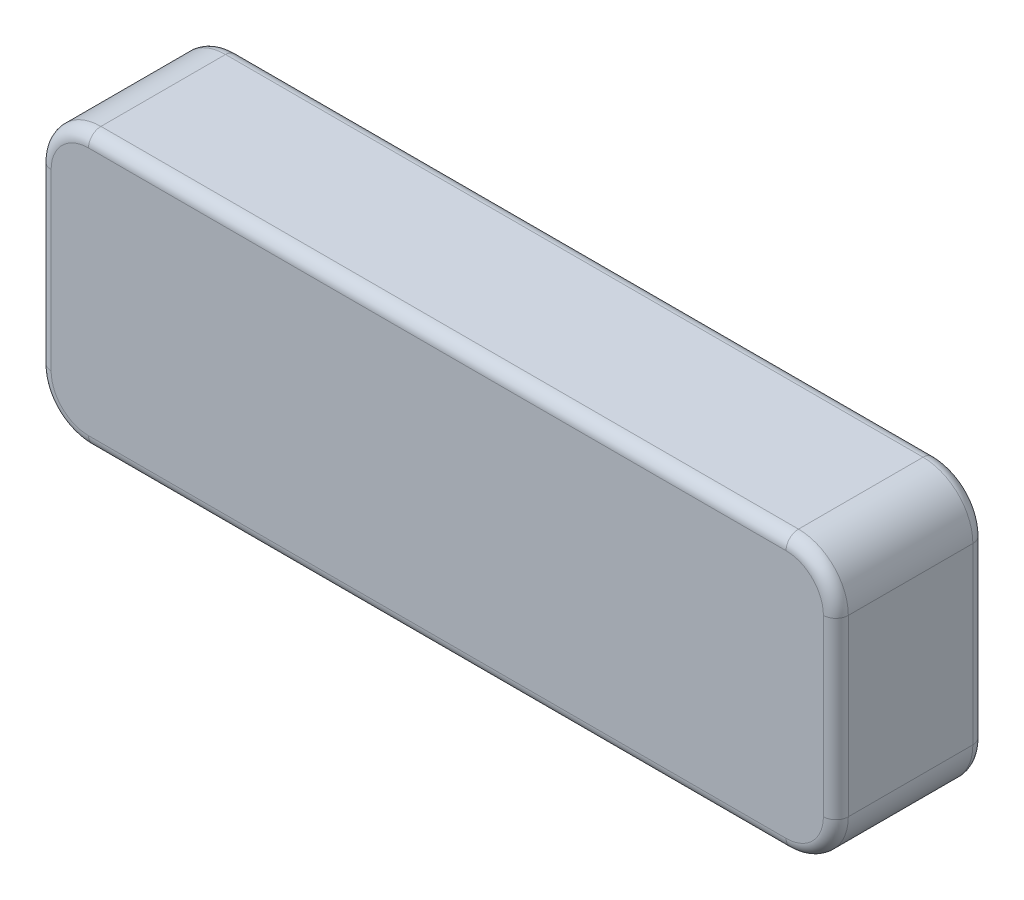
ISO-10303-21;
HEADER;
FILE_DESCRIPTION(('STEP AP214'),'2;1');
FILE_NAME('part.step','',(''),(''),'','','');
FILE_SCHEMA(('AUTOMOTIVE_DESIGN { 1 0 10303 214 1 1 1 1 }'));
ENDSEC;
DATA;
#1=APPLICATION_CONTEXT('core data for automotive mechanical design processes');
#2=APPLICATION_PROTOCOL_DEFINITION('international standard','automotive_design',2000,#1);
#3=PRODUCT_CONTEXT('',#1,'mechanical');
#4=PRODUCT('Part','Part','',(#3));
#5=PRODUCT_RELATED_PRODUCT_CATEGORY('part','',(#4));
#6=PRODUCT_DEFINITION_FORMATION('','',#4);
#7=PRODUCT_DEFINITION_CONTEXT('part definition',#1,'design');
#8=PRODUCT_DEFINITION('design','',#6,#7);
#9=PRODUCT_DEFINITION_SHAPE('','',#8);
#10=(LENGTH_UNIT() NAMED_UNIT(*) SI_UNIT(.MILLI.,.METRE.));
#11=(NAMED_UNIT(*) PLANE_ANGLE_UNIT() SI_UNIT($,.RADIAN.));
#12=(NAMED_UNIT(*) SI_UNIT($,.STERADIAN.) SOLID_ANGLE_UNIT());
#13=UNCERTAINTY_MEASURE_WITH_UNIT(LENGTH_MEASURE(1.E-05),#10,'distance_accuracy_value','');
#14=(GEOMETRIC_REPRESENTATION_CONTEXT(3) GLOBAL_UNCERTAINTY_ASSIGNED_CONTEXT((#13)) GLOBAL_UNIT_ASSIGNED_CONTEXT((#10,
#11,#12)) REPRESENTATION_CONTEXT('',''));
#15=CARTESIAN_POINT('',(0.,0.,0.));
#16=DIRECTION('',(0.,0.,1.));
#17=DIRECTION('',(1.,0.,0.));
#18=AXIS2_PLACEMENT_3D('',#15,#16,#17);
#19=CARTESIAN_POINT('',(203.2,-69.85,76.2));
#20=DIRECTION('',(-1.,0.,0.));
#21=DIRECTION('',(0.,0.,1.));
#22=AXIS2_PLACEMENT_3D('',#19,#20,#21);
#23=PLANE('',#22);
#24=DIRECTION('',(0.,0.,-1.));
#25=VECTOR('',#24,1.);
#26=CARTESIAN_POINT('',(203.2,-44.45,76.2));
#27=LINE('',#26,#25);
#28=CARTESIAN_POINT('',(203.2,-44.45,69.85));
#29=VERTEX_POINT('',#28);
#30=CARTESIAN_POINT('',(203.2,-44.45,6.34999999999999));
#31=VERTEX_POINT('',#30);
#32=EDGE_CURVE('E303',#29,#31,#27,.T.);
#33=ORIENTED_EDGE('',*,*,#32,.T.);
#34=DIRECTION('',(0.,1.,0.));
#35=VECTOR('',#34,1.);
#36=CARTESIAN_POINT('',(203.2,44.45,6.34999999999999));
#37=LINE('',#36,#35);
#38=CARTESIAN_POINT('',(203.2,44.45,6.34999999999999));
#39=VERTEX_POINT('',#38);
#40=EDGE_CURVE('E197',#31,#39,#37,.T.);
#41=ORIENTED_EDGE('',*,*,#40,.T.);
#42=DIRECTION('',(0.,0.,-1.));
#43=VECTOR('',#42,1.);
#44=CARTESIAN_POINT('',(203.2,44.45,76.2));
#45=LINE('',#44,#43);
#46=CARTESIAN_POINT('',(203.2,44.45,69.85));
#47=VERTEX_POINT('',#46);
#48=EDGE_CURVE('E248',#39,#47,#45,.F.);
#49=ORIENTED_EDGE('',*,*,#48,.T.);
#50=DIRECTION('',(0.,1.,0.));
#51=VECTOR('',#50,1.);
#52=CARTESIAN_POINT('',(203.2,-69.85,69.85));
#53=LINE('',#52,#51);
#54=EDGE_CURVE('E195',#47,#29,#53,.F.);
#55=ORIENTED_EDGE('',*,*,#54,.T.);
#56=EDGE_LOOP('',(#33,#41,#49,#55));
#57=FACE_BOUND('',#56,.T.);
#58=ADVANCED_FACE('F32',(#57),#23,.F.);
#59=CARTESIAN_POINT('',(-203.2,69.85,76.2));
#60=DIRECTION('',(0.,-1.,0.));
#61=DIRECTION('',(0.,0.,-1.));
#62=AXIS2_PLACEMENT_3D('',#59,#60,#61);
#63=PLANE('',#62);
#64=DIRECTION('',(0.,0.,-1.));
#65=VECTOR('',#64,1.);
#66=CARTESIAN_POINT('',(177.8,69.85,76.2));
#67=LINE('',#66,#65);
#68=CARTESIAN_POINT('',(177.8,69.85,69.85));
#69=VERTEX_POINT('',#68);
#70=CARTESIAN_POINT('',(177.8,69.85,6.34999999999999));
#71=VERTEX_POINT('',#70);
#72=EDGE_CURVE('E174',#69,#71,#67,.T.);
#73=ORIENTED_EDGE('',*,*,#72,.T.);
#74=DIRECTION('',(-1.,0.,0.));
#75=VECTOR('',#74,1.);
#76=CARTESIAN_POINT('',(-177.8,69.85,6.34999999999999));
#77=LINE('',#76,#75);
#78=CARTESIAN_POINT('',(-177.8,69.85,6.34999999999999));
#79=VERTEX_POINT('',#78);
#80=EDGE_CURVE('E11',#71,#79,#77,.T.);
#81=ORIENTED_EDGE('',*,*,#80,.T.);
#82=DIRECTION('',(0.,0.,-1.));
#83=VECTOR('',#82,1.);
#84=CARTESIAN_POINT('',(-177.8,69.85,76.2));
#85=LINE('',#84,#83);
#86=CARTESIAN_POINT('',(-177.8,69.85,69.85));
#87=VERTEX_POINT('',#86);
#88=EDGE_CURVE('E171',#79,#87,#85,.F.);
#89=ORIENTED_EDGE('',*,*,#88,.T.);
#90=DIRECTION('',(-1.,0.,0.));
#91=VECTOR('',#90,1.);
#92=CARTESIAN_POINT('',(-203.2,69.85,69.85));
#93=LINE('',#92,#91);
#94=EDGE_CURVE('E41',#87,#69,#93,.F.);
#95=ORIENTED_EDGE('',*,*,#94,.T.);
#96=EDGE_LOOP('',(#73,#81,#89,#95));
#97=FACE_BOUND('',#96,.T.);
#98=ADVANCED_FACE('F349',(#97),#63,.F.);
#99=CARTESIAN_POINT('',(-203.2,-69.85,76.2));
#100=DIRECTION('',(1.,0.,0.));
#101=DIRECTION('',(0.,0.,-1.));
#102=AXIS2_PLACEMENT_3D('',#99,#100,#101);
#103=PLANE('',#102);
#104=DIRECTION('',(0.,0.,-1.));
#105=VECTOR('',#104,1.);
#106=CARTESIAN_POINT('',(-203.2,44.45,76.2));
#107=LINE('',#106,#105);
#108=CARTESIAN_POINT('',(-203.2,44.45,69.85));
#109=VERTEX_POINT('',#108);
#110=CARTESIAN_POINT('',(-203.2,44.45,6.34999999999999));
#111=VERTEX_POINT('',#110);
#112=EDGE_CURVE('E294',#109,#111,#107,.T.);
#113=ORIENTED_EDGE('',*,*,#112,.T.);
#114=DIRECTION('',(0.,-1.,0.));
#115=VECTOR('',#114,1.);
#116=CARTESIAN_POINT('',(-203.2,-44.45,6.34999999999999));
#117=LINE('',#116,#115);
#118=CARTESIAN_POINT('',(-203.2,-44.45,6.34999999999999));
#119=VERTEX_POINT('',#118);
#120=EDGE_CURVE('E213',#111,#119,#117,.T.);
#121=ORIENTED_EDGE('',*,*,#120,.T.);
#122=DIRECTION('',(0.,0.,-1.));
#123=VECTOR('',#122,1.);
#124=CARTESIAN_POINT('',(-203.2,-44.45,76.2));
#125=LINE('',#124,#123);
#126=CARTESIAN_POINT('',(-203.2,-44.45,69.85));
#127=VERTEX_POINT('',#126);
#128=EDGE_CURVE('E285',#119,#127,#125,.F.);
#129=ORIENTED_EDGE('',*,*,#128,.T.);
#130=DIRECTION('',(0.,-1.,0.));
#131=VECTOR('',#130,1.);
#132=CARTESIAN_POINT('',(-203.2,-69.85,69.85));
#133=LINE('',#132,#131);
#134=EDGE_CURVE('E211',#127,#109,#133,.F.);
#135=ORIENTED_EDGE('',*,*,#134,.T.);
#136=EDGE_LOOP('',(#113,#121,#129,#135));
#137=FACE_BOUND('',#136,.T.);
#138=ADVANCED_FACE('F291',(#137),#103,.F.);
#139=CARTESIAN_POINT('',(-203.2,-69.85,76.2));
#140=DIRECTION('',(0.,1.,0.));
#141=DIRECTION('',(0.,0.,1.));
#142=AXIS2_PLACEMENT_3D('',#139,#140,#141);
#143=PLANE('',#142);
#144=DIRECTION('',(0.,0.,-1.));
#145=VECTOR('',#144,1.);
#146=CARTESIAN_POINT('',(-177.8,-69.85,76.2));
#147=LINE('',#146,#145);
#148=CARTESIAN_POINT('',(-177.8,-69.85,69.85));
#149=VERTEX_POINT('',#148);
#150=CARTESIAN_POINT('',(-177.8,-69.85,6.34999999999999));
#151=VERTEX_POINT('',#150);
#152=EDGE_CURVE('E288',#149,#151,#147,.T.);
#153=ORIENTED_EDGE('',*,*,#152,.T.);
#154=DIRECTION('',(1.,0.,0.));
#155=VECTOR('',#154,1.);
#156=CARTESIAN_POINT('',(177.8,-69.85,6.34999999999999));
#157=LINE('',#156,#155);
#158=CARTESIAN_POINT('',(177.8,-69.85,6.34999999999999));
#159=VERTEX_POINT('',#158);
#160=EDGE_CURVE('E205',#151,#159,#157,.T.);
#161=ORIENTED_EDGE('',*,*,#160,.T.);
#162=DIRECTION('',(0.,0.,-1.));
#163=VECTOR('',#162,1.);
#164=CARTESIAN_POINT('',(177.8,-69.85,76.2));
#165=LINE('',#164,#163);
#166=CARTESIAN_POINT('',(177.8,-69.85,69.85));
#167=VERTEX_POINT('',#166);
#168=EDGE_CURVE('E297',#159,#167,#165,.F.);
#169=ORIENTED_EDGE('',*,*,#168,.T.);
#170=DIRECTION('',(1.,0.,0.));
#171=VECTOR('',#170,1.);
#172=CARTESIAN_POINT('',(-203.2,-69.85,69.85));
#173=LINE('',#172,#171);
#174=EDGE_CURVE('E203',#167,#149,#173,.F.);
#175=ORIENTED_EDGE('',*,*,#174,.T.);
#176=EDGE_LOOP('',(#153,#161,#169,#175));
#177=FACE_BOUND('',#176,.T.);
#178=ADVANCED_FACE('F531',(#177),#143,.F.);
#179=CARTESIAN_POINT('',(0.,0.,76.2));
#180=DIRECTION('',(0.,0.,-1.));
#181=DIRECTION('',(-1.,0.,0.));
#182=AXIS2_PLACEMENT_3D('',#179,#180,#181);
#183=PLANE('',#182);
#184=DIRECTION('',(0.,1.,0.));
#185=VECTOR('',#184,1.);
#186=CARTESIAN_POINT('',(196.85,0.,76.2));
#187=LINE('',#186,#185);
#188=CARTESIAN_POINT('',(196.85,-44.45,76.2));
#189=VERTEX_POINT('',#188);
#190=CARTESIAN_POINT('',(196.85,44.45,76.2));
#191=VERTEX_POINT('',#190);
#192=EDGE_CURVE('E49',#189,#191,#187,.T.);
#193=ORIENTED_EDGE('',*,*,#192,.T.);
#194=CARTESIAN_POINT('',(177.8,44.45,76.2));
#195=DIRECTION('',(0.,0.,-1.));
#196=DIRECTION('',(-1.,0.,0.));
#197=AXIS2_PLACEMENT_3D('',#194,#195,#196);
#198=CIRCLE('',#197,19.05);
#199=CARTESIAN_POINT('',(177.8,63.5,76.2));
#200=VERTEX_POINT('',#199);
#201=EDGE_CURVE('E230',#191,#200,#198,.F.);
#202=ORIENTED_EDGE('',*,*,#201,.T.);
#203=DIRECTION('',(-1.,0.,0.));
#204=VECTOR('',#203,1.);
#205=CARTESIAN_POINT('',(0.,63.5,76.2));
#206=LINE('',#205,#204);
#207=CARTESIAN_POINT('',(-177.8,63.5,76.2));
#208=VERTEX_POINT('',#207);
#209=EDGE_CURVE('E218',#200,#208,#206,.T.);
#210=ORIENTED_EDGE('',*,*,#209,.T.);
#211=CARTESIAN_POINT('',(-177.8,44.45,76.2));
#212=DIRECTION('',(0.,0.,-1.));
#213=DIRECTION('',(-1.,0.,0.));
#214=AXIS2_PLACEMENT_3D('',#211,#212,#213);
#215=CIRCLE('',#214,19.05);
#216=CARTESIAN_POINT('',(-196.85,44.45,76.2));
#217=VERTEX_POINT('',#216);
#218=EDGE_CURVE('E220',#208,#217,#215,.F.);
#219=ORIENTED_EDGE('',*,*,#218,.T.);
#220=DIRECTION('',(0.,-1.,0.));
#221=VECTOR('',#220,1.);
#222=CARTESIAN_POINT('',(-196.85,0.,76.2));
#223=LINE('',#222,#221);
#224=CARTESIAN_POINT('',(-196.85,-44.45,76.2));
#225=VERTEX_POINT('',#224);
#226=EDGE_CURVE('E222',#217,#225,#223,.T.);
#227=ORIENTED_EDGE('',*,*,#226,.T.);
#228=CARTESIAN_POINT('',(-177.8,-44.45,76.2));
#229=DIRECTION('',(0.,0.,-1.));
#230=DIRECTION('',(-1.,0.,0.));
#231=AXIS2_PLACEMENT_3D('',#228,#229,#230);
#232=CIRCLE('',#231,19.05);
#233=CARTESIAN_POINT('',(-177.8,-63.5,76.2));
#234=VERTEX_POINT('',#233);
#235=EDGE_CURVE('E224',#225,#234,#232,.F.);
#236=ORIENTED_EDGE('',*,*,#235,.T.);
#237=DIRECTION('',(1.,0.,0.));
#238=VECTOR('',#237,1.);
#239=CARTESIAN_POINT('',(0.,-63.5,76.2));
#240=LINE('',#239,#238);
#241=CARTESIAN_POINT('',(177.8,-63.5,76.2));
#242=VERTEX_POINT('',#241);
#243=EDGE_CURVE('E226',#234,#242,#240,.T.);
#244=ORIENTED_EDGE('',*,*,#243,.T.);
#245=CARTESIAN_POINT('',(177.8,-44.45,76.2));
#246=DIRECTION('',(0.,0.,-1.));
#247=DIRECTION('',(-1.,0.,0.));
#248=AXIS2_PLACEMENT_3D('',#245,#246,#247);
#249=CIRCLE('',#248,19.05);
#250=EDGE_CURVE('E54',#242,#189,#249,.F.);
#251=ORIENTED_EDGE('',*,*,#250,.T.);
#252=EDGE_LOOP('',(#193,#202,#210,#219,#227,#236,#244,#251));
#253=FACE_BOUND('',#252,.T.);
#254=ADVANCED_FACE('F523',(#253),#183,.F.);
#255=CARTESIAN_POINT('',(0.,0.,0.));
#256=DIRECTION('',(0.,0.,-1.));
#257=DIRECTION('',(-1.,0.,0.));
#258=AXIS2_PLACEMENT_3D('',#255,#256,#257);
#259=PLANE('',#258);
#260=DIRECTION('',(-1.,0.,0.));
#261=VECTOR('',#260,1.);
#262=CARTESIAN_POINT('',(177.8,63.5,0.));
#263=LINE('',#262,#261);
#264=CARTESIAN_POINT('',(-177.8,63.5,0.));
#265=VERTEX_POINT('',#264);
#266=CARTESIAN_POINT('',(177.8,63.5,0.));
#267=VERTEX_POINT('',#266);
#268=EDGE_CURVE('E150',#265,#267,#263,.F.);
#269=ORIENTED_EDGE('',*,*,#268,.T.);
#270=CARTESIAN_POINT('',(177.8,44.45,0.));
#271=DIRECTION('',(0.,0.,-1.));
#272=DIRECTION('',(-1.,0.,0.));
#273=AXIS2_PLACEMENT_3D('',#270,#271,#272);
#274=CIRCLE('',#273,19.05);
#275=CARTESIAN_POINT('',(196.85,44.45,0.));
#276=VERTEX_POINT('',#275);
#277=EDGE_CURVE('E187',#267,#276,#274,.T.);
#278=ORIENTED_EDGE('',*,*,#277,.T.);
#279=DIRECTION('',(0.,1.,0.));
#280=VECTOR('',#279,1.);
#281=CARTESIAN_POINT('',(196.85,-44.45,0.));
#282=LINE('',#281,#280);
#283=CARTESIAN_POINT('',(196.85,-44.45,0.));
#284=VERTEX_POINT('',#283);
#285=EDGE_CURVE('E185',#276,#284,#282,.F.);
#286=ORIENTED_EDGE('',*,*,#285,.T.);
#287=CARTESIAN_POINT('',(177.8,-44.45,0.));
#288=DIRECTION('',(0.,0.,-1.));
#289=DIRECTION('',(-1.,0.,0.));
#290=AXIS2_PLACEMENT_3D('',#287,#288,#289);
#291=CIRCLE('',#290,19.05);
#292=CARTESIAN_POINT('',(177.8,-63.5,0.));
#293=VERTEX_POINT('',#292);
#294=EDGE_CURVE('E183',#284,#293,#291,.T.);
#295=ORIENTED_EDGE('',*,*,#294,.T.);
#296=DIRECTION('',(1.,0.,0.));
#297=VECTOR('',#296,1.);
#298=CARTESIAN_POINT('',(-177.8,-63.5,0.));
#299=LINE('',#298,#297);
#300=CARTESIAN_POINT('',(-177.8,-63.5,0.));
#301=VERTEX_POINT('',#300);
#302=EDGE_CURVE('E181',#293,#301,#299,.F.);
#303=ORIENTED_EDGE('',*,*,#302,.T.);
#304=CARTESIAN_POINT('',(-177.8,-44.45,0.));
#305=DIRECTION('',(0.,0.,-1.));
#306=DIRECTION('',(-1.,0.,0.));
#307=AXIS2_PLACEMENT_3D('',#304,#305,#306);
#308=CIRCLE('',#307,19.05);
#309=CARTESIAN_POINT('',(-196.85,-44.45,0.));
#310=VERTEX_POINT('',#309);
#311=EDGE_CURVE('E179',#301,#310,#308,.T.);
#312=ORIENTED_EDGE('',*,*,#311,.T.);
#313=DIRECTION('',(0.,-1.,0.));
#314=VECTOR('',#313,1.);
#315=CARTESIAN_POINT('',(-196.85,44.45,0.));
#316=LINE('',#315,#314);
#317=CARTESIAN_POINT('',(-196.85,44.45,0.));
#318=VERTEX_POINT('',#317);
#319=EDGE_CURVE('E153',#310,#318,#316,.F.);
#320=ORIENTED_EDGE('',*,*,#319,.T.);
#321=CARTESIAN_POINT('',(-177.8,44.45,0.));
#322=DIRECTION('',(0.,0.,-1.));
#323=DIRECTION('',(-1.,0.,0.));
#324=AXIS2_PLACEMENT_3D('',#321,#322,#323);
#325=CIRCLE('',#324,19.05);
#326=EDGE_CURVE('E145',#318,#265,#325,.T.);
#327=ORIENTED_EDGE('',*,*,#326,.T.);
#328=EDGE_LOOP('',(#269,#278,#286,#295,#303,#312,#320,#327));
#329=FACE_BOUND('',#328,.T.);
#330=ADVANCED_FACE('F147',(#329),#259,.T.);
#331=CARTESIAN_POINT('',(177.8,-44.45,76.2));
#332=DIRECTION('',(0.,0.,-1.));
#333=DIRECTION('',(-1.,0.,0.));
#334=AXIS2_PLACEMENT_3D('',#331,#332,#333);
#335=CYLINDRICAL_SURFACE('',#334,25.4);
#336=ORIENTED_EDGE('',*,*,#168,.F.);
#337=CARTESIAN_POINT('',(177.8,-44.45,6.34999999999999));
#338=DIRECTION('',(0.,0.,-1.));
#339=DIRECTION('',(-1.,0.,0.));
#340=AXIS2_PLACEMENT_3D('',#337,#338,#339);
#341=CIRCLE('',#340,25.4);
#342=EDGE_CURVE('E201',#159,#31,#341,.F.);
#343=ORIENTED_EDGE('',*,*,#342,.T.);
#344=ORIENTED_EDGE('',*,*,#32,.F.);
#345=CARTESIAN_POINT('',(177.8,-44.45,69.85));
#346=DIRECTION('',(0.,0.,-1.));
#347=DIRECTION('',(-1.,0.,0.));
#348=AXIS2_PLACEMENT_3D('',#345,#346,#347);
#349=CIRCLE('',#348,25.4);
#350=EDGE_CURVE('E199',#29,#167,#349,.T.);
#351=ORIENTED_EDGE('',*,*,#350,.T.);
#352=EDGE_LOOP('',(#336,#343,#344,#351));
#353=FACE_BOUND('',#352,.T.);
#354=ADVANCED_FACE('F358',(#353),#335,.T.);
#355=CARTESIAN_POINT('',(-177.8,-44.45,76.2));
#356=DIRECTION('',(0.,0.,-1.));
#357=DIRECTION('',(-1.,0.,0.));
#358=AXIS2_PLACEMENT_3D('',#355,#356,#357);
#359=CYLINDRICAL_SURFACE('',#358,25.4);
#360=ORIENTED_EDGE('',*,*,#128,.F.);
#361=CARTESIAN_POINT('',(-177.8,-44.45,6.34999999999999));
#362=DIRECTION('',(0.,0.,-1.));
#363=DIRECTION('',(-1.,0.,0.));
#364=AXIS2_PLACEMENT_3D('',#361,#362,#363);
#365=CIRCLE('',#364,25.4);
#366=EDGE_CURVE('E209',#119,#151,#365,.F.);
#367=ORIENTED_EDGE('',*,*,#366,.T.);
#368=ORIENTED_EDGE('',*,*,#152,.F.);
#369=CARTESIAN_POINT('',(-177.8,-44.45,69.85));
#370=DIRECTION('',(0.,0.,-1.));
#371=DIRECTION('',(-1.,0.,0.));
#372=AXIS2_PLACEMENT_3D('',#369,#370,#371);
#373=CIRCLE('',#372,25.4);
#374=EDGE_CURVE('E207',#149,#127,#373,.T.);
#375=ORIENTED_EDGE('',*,*,#374,.T.);
#376=EDGE_LOOP('',(#360,#367,#368,#375));
#377=FACE_BOUND('',#376,.T.);
#378=ADVANCED_FACE('F284',(#377),#359,.T.);
#379=CARTESIAN_POINT('',(-177.8,44.45,76.2));
#380=DIRECTION('',(0.,0.,-1.));
#381=DIRECTION('',(-1.,0.,0.));
#382=AXIS2_PLACEMENT_3D('',#379,#380,#381);
#383=CYLINDRICAL_SURFACE('',#382,25.4);
#384=ORIENTED_EDGE('',*,*,#88,.F.);
#385=CARTESIAN_POINT('',(-177.8,44.45,6.34999999999999));
#386=DIRECTION('',(0.,0.,-1.));
#387=DIRECTION('',(-1.,0.,0.));
#388=AXIS2_PLACEMENT_3D('',#385,#386,#387);
#389=CIRCLE('',#388,25.4);
#390=EDGE_CURVE('E162',#79,#111,#389,.F.);
#391=ORIENTED_EDGE('',*,*,#390,.T.);
#392=ORIENTED_EDGE('',*,*,#112,.F.);
#393=CARTESIAN_POINT('',(-177.8,44.45,69.85));
#394=DIRECTION('',(0.,0.,-1.));
#395=DIRECTION('',(-1.,0.,0.));
#396=AXIS2_PLACEMENT_3D('',#393,#394,#395);
#397=CIRCLE('',#396,25.4);
#398=EDGE_CURVE('E215',#109,#87,#397,.T.);
#399=ORIENTED_EDGE('',*,*,#398,.T.);
#400=EDGE_LOOP('',(#384,#391,#392,#399));
#401=FACE_BOUND('',#400,.T.);
#402=ADVANCED_FACE('F364',(#401),#383,.T.);
#403=CARTESIAN_POINT('',(177.8,44.45,76.2));
#404=DIRECTION('',(0.,0.,-1.));
#405=DIRECTION('',(-1.,0.,0.));
#406=AXIS2_PLACEMENT_3D('',#403,#404,#405);
#407=CYLINDRICAL_SURFACE('',#406,25.4);
#408=ORIENTED_EDGE('',*,*,#48,.F.);
#409=CARTESIAN_POINT('',(177.8,44.45,6.34999999999999));
#410=DIRECTION('',(0.,0.,-1.));
#411=DIRECTION('',(-1.,0.,0.));
#412=AXIS2_PLACEMENT_3D('',#409,#410,#411);
#413=CIRCLE('',#412,25.4);
#414=EDGE_CURVE('E192',#39,#71,#413,.F.);
#415=ORIENTED_EDGE('',*,*,#414,.T.);
#416=ORIENTED_EDGE('',*,*,#72,.F.);
#417=CARTESIAN_POINT('',(177.8,44.45,69.85));
#418=DIRECTION('',(0.,0.,-1.));
#419=DIRECTION('',(-1.,0.,0.));
#420=AXIS2_PLACEMENT_3D('',#417,#418,#419);
#421=CIRCLE('',#420,25.4);
#422=EDGE_CURVE('E189',#69,#47,#421,.T.);
#423=ORIENTED_EDGE('',*,*,#422,.T.);
#424=EDGE_LOOP('',(#408,#415,#416,#423));
#425=FACE_BOUND('',#424,.T.);
#426=ADVANCED_FACE('F314',(#425),#407,.T.);
#427=CARTESIAN_POINT('',(-177.8,-44.45,6.34999999999999));
#428=DIRECTION('',(0.,0.,-1.));
#429=DIRECTION('',(-1.,0.,0.));
#430=AXIS2_PLACEMENT_3D('',#427,#428,#429);
#431=TOROIDAL_SURFACE('',#430,19.05,6.35);
#432=CARTESIAN_POINT('',(-177.8,-63.5,6.34999999999999));
#433=DIRECTION('',(1.,0.,0.));
#434=DIRECTION('',(0.,0.,-1.));
#435=AXIS2_PLACEMENT_3D('',#432,#433,#434);
#436=CIRCLE('',#435,6.35);
#437=EDGE_CURVE('E242',#151,#301,#436,.T.);
#438=ORIENTED_EDGE('',*,*,#437,.F.);
#439=ORIENTED_EDGE('',*,*,#366,.F.);
#440=CARTESIAN_POINT('',(-196.85,-44.45,6.35));
#441=DIRECTION('',(0.,1.,0.));
#442=DIRECTION('',(0.,0.,1.));
#443=AXIS2_PLACEMENT_3D('',#440,#441,#442);
#444=CIRCLE('',#443,6.35);
#445=EDGE_CURVE('E245',#310,#119,#444,.T.);
#446=ORIENTED_EDGE('',*,*,#445,.F.);
#447=ORIENTED_EDGE('',*,*,#311,.F.);
#448=EDGE_LOOP('',(#438,#439,#446,#447));
#449=FACE_BOUND('',#448,.T.);
#450=ADVANCED_FACE('F337',(#449),#431,.T.);
#451=CARTESIAN_POINT('',(-196.85,-69.85,6.34999999999999));
#452=DIRECTION('',(0.,1.,0.));
#453=DIRECTION('',(0.,0.,1.));
#454=AXIS2_PLACEMENT_3D('',#451,#452,#453);
#455=CYLINDRICAL_SURFACE('',#454,6.35);
#456=ORIENTED_EDGE('',*,*,#445,.T.);
#457=ORIENTED_EDGE('',*,*,#120,.F.);
#458=CARTESIAN_POINT('',(-196.85,44.45,6.35));
#459=DIRECTION('',(0.,1.,0.));
#460=DIRECTION('',(0.,0.,1.));
#461=AXIS2_PLACEMENT_3D('',#458,#459,#460);
#462=CIRCLE('',#461,6.35);
#463=EDGE_CURVE('E240',#318,#111,#462,.T.);
#464=ORIENTED_EDGE('',*,*,#463,.F.);
#465=ORIENTED_EDGE('',*,*,#319,.F.);
#466=EDGE_LOOP('',(#456,#457,#464,#465));
#467=FACE_BOUND('',#466,.T.);
#468=ADVANCED_FACE('F339',(#467),#455,.T.);
#469=CARTESIAN_POINT('',(-203.2,-63.5,6.34999999999999));
#470=DIRECTION('',(-1.,0.,0.));
#471=DIRECTION('',(0.,0.,1.));
#472=AXIS2_PLACEMENT_3D('',#469,#470,#471);
#473=CYLINDRICAL_SURFACE('',#472,6.35);
#474=ORIENTED_EDGE('',*,*,#437,.T.);
#475=ORIENTED_EDGE('',*,*,#302,.F.);
#476=CARTESIAN_POINT('',(177.8,-63.5,6.34999999999999));
#477=DIRECTION('',(1.,0.,0.));
#478=DIRECTION('',(0.,0.,-1.));
#479=AXIS2_PLACEMENT_3D('',#476,#477,#478);
#480=CIRCLE('',#479,6.35);
#481=EDGE_CURVE('E165',#159,#293,#480,.T.);
#482=ORIENTED_EDGE('',*,*,#481,.F.);
#483=ORIENTED_EDGE('',*,*,#160,.F.);
#484=EDGE_LOOP('',(#474,#475,#482,#483));
#485=FACE_BOUND('',#484,.T.);
#486=ADVANCED_FACE('F332',(#485),#473,.T.);
#487=CARTESIAN_POINT('',(-177.8,44.45,6.34999999999999));
#488=DIRECTION('',(0.,0.,-1.));
#489=DIRECTION('',(-1.,0.,0.));
#490=AXIS2_PLACEMENT_3D('',#487,#488,#489);
#491=TOROIDAL_SURFACE('',#490,19.05,6.35);
#492=ORIENTED_EDGE('',*,*,#463,.T.);
#493=ORIENTED_EDGE('',*,*,#390,.F.);
#494=CARTESIAN_POINT('',(-177.8,63.5,6.35));
#495=DIRECTION('',(1.,0.,0.));
#496=DIRECTION('',(0.,0.,-1.));
#497=AXIS2_PLACEMENT_3D('',#494,#495,#496);
#498=CIRCLE('',#497,6.35);
#499=EDGE_CURVE('E160',#265,#79,#498,.T.);
#500=ORIENTED_EDGE('',*,*,#499,.F.);
#501=ORIENTED_EDGE('',*,*,#326,.F.);
#502=EDGE_LOOP('',(#492,#493,#500,#501));
#503=FACE_BOUND('',#502,.T.);
#504=ADVANCED_FACE('F161',(#503),#491,.T.);
#505=CARTESIAN_POINT('',(177.8,-44.45,6.34999999999999));
#506=DIRECTION('',(0.,0.,-1.));
#507=DIRECTION('',(-1.,0.,0.));
#508=AXIS2_PLACEMENT_3D('',#505,#506,#507);
#509=TOROIDAL_SURFACE('',#508,19.05,6.35);
#510=ORIENTED_EDGE('',*,*,#481,.T.);
#511=ORIENTED_EDGE('',*,*,#294,.F.);
#512=CARTESIAN_POINT('',(196.85,-44.45,6.34999999999999));
#513=DIRECTION('',(0.,1.,0.));
#514=DIRECTION('',(0.,0.,1.));
#515=AXIS2_PLACEMENT_3D('',#512,#513,#514);
#516=CIRCLE('',#515,6.35);
#517=EDGE_CURVE('E166',#31,#284,#516,.T.);
#518=ORIENTED_EDGE('',*,*,#517,.F.);
#519=ORIENTED_EDGE('',*,*,#342,.F.);
#520=EDGE_LOOP('',(#510,#511,#518,#519));
#521=FACE_BOUND('',#520,.T.);
#522=ADVANCED_FACE('F327',(#521),#509,.T.);
#523=CARTESIAN_POINT('',(-203.2,63.5,6.34999999999999));
#524=DIRECTION('',(1.,0.,0.));
#525=DIRECTION('',(0.,0.,-1.));
#526=AXIS2_PLACEMENT_3D('',#523,#524,#525);
#527=CYLINDRICAL_SURFACE('',#526,6.35);
#528=ORIENTED_EDGE('',*,*,#499,.T.);
#529=ORIENTED_EDGE('',*,*,#80,.F.);
#530=CARTESIAN_POINT('',(177.8,63.5,6.35));
#531=DIRECTION('',(1.,0.,0.));
#532=DIRECTION('',(0.,0.,-1.));
#533=AXIS2_PLACEMENT_3D('',#530,#531,#532);
#534=CIRCLE('',#533,6.35);
#535=EDGE_CURVE('E169',#267,#71,#534,.T.);
#536=ORIENTED_EDGE('',*,*,#535,.F.);
#537=ORIENTED_EDGE('',*,*,#268,.F.);
#538=EDGE_LOOP('',(#528,#529,#536,#537));
#539=FACE_BOUND('',#538,.T.);
#540=ADVANCED_FACE('F168',(#539),#527,.T.);
#541=CARTESIAN_POINT('',(196.85,-69.85,6.34999999999999));
#542=DIRECTION('',(0.,-1.,0.));
#543=DIRECTION('',(0.,0.,-1.));
#544=AXIS2_PLACEMENT_3D('',#541,#542,#543);
#545=CYLINDRICAL_SURFACE('',#544,6.35);
#546=ORIENTED_EDGE('',*,*,#517,.T.);
#547=ORIENTED_EDGE('',*,*,#285,.F.);
#548=CARTESIAN_POINT('',(196.85,44.45,6.34999999999999));
#549=DIRECTION('',(0.,1.,0.));
#550=DIRECTION('',(0.,0.,1.));
#551=AXIS2_PLACEMENT_3D('',#548,#549,#550);
#552=CIRCLE('',#551,6.35);
#553=EDGE_CURVE('E233',#39,#276,#552,.T.);
#554=ORIENTED_EDGE('',*,*,#553,.F.);
#555=ORIENTED_EDGE('',*,*,#40,.F.);
#556=EDGE_LOOP('',(#546,#547,#554,#555));
#557=FACE_BOUND('',#556,.T.);
#558=ADVANCED_FACE('F322',(#557),#545,.T.);
#559=CARTESIAN_POINT('',(177.8,44.45,6.34999999999999));
#560=DIRECTION('',(0.,0.,-1.));
#561=DIRECTION('',(-1.,0.,0.));
#562=AXIS2_PLACEMENT_3D('',#559,#560,#561);
#563=TOROIDAL_SURFACE('',#562,19.05,6.35);
#564=ORIENTED_EDGE('',*,*,#535,.T.);
#565=ORIENTED_EDGE('',*,*,#414,.F.);
#566=ORIENTED_EDGE('',*,*,#553,.T.);
#567=ORIENTED_EDGE('',*,*,#277,.F.);
#568=EDGE_LOOP('',(#564,#565,#566,#567));
#569=FACE_BOUND('',#568,.T.);
#570=ADVANCED_FACE('F319',(#569),#563,.T.);
#571=CARTESIAN_POINT('',(-177.8,-44.45,69.85));
#572=DIRECTION('',(0.,0.,-1.));
#573=DIRECTION('',(-1.,0.,0.));
#574=AXIS2_PLACEMENT_3D('',#571,#572,#573);
#575=TOROIDAL_SURFACE('',#574,19.05,6.35);
#576=CARTESIAN_POINT('',(-196.85,-44.45,69.85));
#577=DIRECTION('',(0.,1.,0.));
#578=DIRECTION('',(0.,0.,1.));
#579=AXIS2_PLACEMENT_3D('',#576,#577,#578);
#580=CIRCLE('',#579,6.35);
#581=EDGE_CURVE('E264',#127,#225,#580,.T.);
#582=ORIENTED_EDGE('',*,*,#581,.F.);
#583=ORIENTED_EDGE('',*,*,#374,.F.);
#584=CARTESIAN_POINT('',(-177.8,-63.5,69.85));
#585=DIRECTION('',(1.,0.,0.));
#586=DIRECTION('',(0.,0.,-1.));
#587=AXIS2_PLACEMENT_3D('',#584,#585,#586);
#588=CIRCLE('',#587,6.35);
#589=EDGE_CURVE('E36',#234,#149,#588,.T.);
#590=ORIENTED_EDGE('',*,*,#589,.F.);
#591=ORIENTED_EDGE('',*,*,#235,.F.);
#592=EDGE_LOOP('',(#582,#583,#590,#591));
#593=FACE_BOUND('',#592,.T.);
#594=ADVANCED_FACE('F34',(#593),#575,.T.);
#595=CARTESIAN_POINT('',(0.,-63.5,69.85));
#596=DIRECTION('',(1.,0.,0.));
#597=DIRECTION('',(0.,0.,-1.));
#598=AXIS2_PLACEMENT_3D('',#595,#596,#597);
#599=CYLINDRICAL_SURFACE('',#598,6.35);
#600=ORIENTED_EDGE('',*,*,#589,.T.);
#601=ORIENTED_EDGE('',*,*,#174,.F.);
#602=CARTESIAN_POINT('',(177.8,-63.5,69.85));
#603=DIRECTION('',(1.,0.,0.));
#604=DIRECTION('',(0.,0.,-1.));
#605=AXIS2_PLACEMENT_3D('',#602,#603,#604);
#606=CIRCLE('',#605,6.35);
#607=EDGE_CURVE('E262',#242,#167,#606,.T.);
#608=ORIENTED_EDGE('',*,*,#607,.F.);
#609=ORIENTED_EDGE('',*,*,#243,.F.);
#610=EDGE_LOOP('',(#600,#601,#608,#609));
#611=FACE_BOUND('',#610,.T.);
#612=ADVANCED_FACE('F275',(#611),#599,.T.);
#613=CARTESIAN_POINT('',(-196.85,0.,69.85));
#614=DIRECTION('',(0.,-1.,0.));
#615=DIRECTION('',(0.,0.,-1.));
#616=AXIS2_PLACEMENT_3D('',#613,#614,#615);
#617=CYLINDRICAL_SURFACE('',#616,6.35);
#618=ORIENTED_EDGE('',*,*,#581,.T.);
#619=ORIENTED_EDGE('',*,*,#226,.F.);
#620=CARTESIAN_POINT('',(-196.85,44.45,69.85));
#621=DIRECTION('',(0.,1.,0.));
#622=DIRECTION('',(0.,0.,1.));
#623=AXIS2_PLACEMENT_3D('',#620,#621,#622);
#624=CIRCLE('',#623,6.35);
#625=EDGE_CURVE('E259',#109,#217,#624,.T.);
#626=ORIENTED_EDGE('',*,*,#625,.F.);
#627=ORIENTED_EDGE('',*,*,#134,.F.);
#628=EDGE_LOOP('',(#618,#619,#626,#627));
#629=FACE_BOUND('',#628,.T.);
#630=ADVANCED_FACE('F410',(#629),#617,.T.);
#631=CARTESIAN_POINT('',(177.8,-44.45,69.85));
#632=DIRECTION('',(0.,0.,-1.));
#633=DIRECTION('',(-1.,0.,0.));
#634=AXIS2_PLACEMENT_3D('',#631,#632,#633);
#635=TOROIDAL_SURFACE('',#634,19.05,6.35);
#636=ORIENTED_EDGE('',*,*,#607,.T.);
#637=ORIENTED_EDGE('',*,*,#350,.F.);
#638=CARTESIAN_POINT('',(196.85,-44.45,69.85));
#639=DIRECTION('',(0.,1.,0.));
#640=DIRECTION('',(0.,0.,1.));
#641=AXIS2_PLACEMENT_3D('',#638,#639,#640);
#642=CIRCLE('',#641,6.35);
#643=EDGE_CURVE('E256',#189,#29,#642,.T.);
#644=ORIENTED_EDGE('',*,*,#643,.F.);
#645=ORIENTED_EDGE('',*,*,#250,.F.);
#646=EDGE_LOOP('',(#636,#637,#644,#645));
#647=FACE_BOUND('',#646,.T.);
#648=ADVANCED_FACE('F416',(#647),#635,.T.);
#649=CARTESIAN_POINT('',(-177.8,44.45,69.85));
#650=DIRECTION('',(0.,0.,-1.));
#651=DIRECTION('',(-1.,0.,0.));
#652=AXIS2_PLACEMENT_3D('',#649,#650,#651);
#653=TOROIDAL_SURFACE('',#652,19.05,6.35);
#654=ORIENTED_EDGE('',*,*,#625,.T.);
#655=ORIENTED_EDGE('',*,*,#218,.F.);
#656=CARTESIAN_POINT('',(-177.8,63.5,69.85));
#657=DIRECTION('',(1.,0.,0.));
#658=DIRECTION('',(0.,0.,-1.));
#659=AXIS2_PLACEMENT_3D('',#656,#657,#658);
#660=CIRCLE('',#659,6.35);
#661=EDGE_CURVE('E253',#87,#208,#660,.T.);
#662=ORIENTED_EDGE('',*,*,#661,.F.);
#663=ORIENTED_EDGE('',*,*,#398,.F.);
#664=EDGE_LOOP('',(#654,#655,#662,#663));
#665=FACE_BOUND('',#664,.T.);
#666=ADVANCED_FACE('F423',(#665),#653,.T.);
#667=CARTESIAN_POINT('',(196.85,0.,69.85));
#668=DIRECTION('',(0.,1.,0.));
#669=DIRECTION('',(0.,0.,1.));
#670=AXIS2_PLACEMENT_3D('',#667,#668,#669);
#671=CYLINDRICAL_SURFACE('',#670,6.35);
#672=ORIENTED_EDGE('',*,*,#643,.T.);
#673=ORIENTED_EDGE('',*,*,#54,.F.);
#674=CARTESIAN_POINT('',(196.85,44.45,69.85));
#675=DIRECTION('',(0.,1.,0.));
#676=DIRECTION('',(0.,0.,1.));
#677=AXIS2_PLACEMENT_3D('',#674,#675,#676);
#678=CIRCLE('',#677,6.35);
#679=EDGE_CURVE('E251',#191,#47,#678,.T.);
#680=ORIENTED_EDGE('',*,*,#679,.F.);
#681=ORIENTED_EDGE('',*,*,#192,.F.);
#682=EDGE_LOOP('',(#672,#673,#680,#681));
#683=FACE_BOUND('',#682,.T.);
#684=ADVANCED_FACE('F431',(#683),#671,.T.);
#685=CARTESIAN_POINT('',(0.,63.5,69.85));
#686=DIRECTION('',(-1.,0.,0.));
#687=DIRECTION('',(0.,0.,1.));
#688=AXIS2_PLACEMENT_3D('',#685,#686,#687);
#689=CYLINDRICAL_SURFACE('',#688,6.35);
#690=ORIENTED_EDGE('',*,*,#661,.T.);
#691=ORIENTED_EDGE('',*,*,#209,.F.);
#692=CARTESIAN_POINT('',(177.8,63.5,69.85));
#693=DIRECTION('',(1.,0.,0.));
#694=DIRECTION('',(0.,0.,-1.));
#695=AXIS2_PLACEMENT_3D('',#692,#693,#694);
#696=CIRCLE('',#695,6.35);
#697=EDGE_CURVE('E249',#69,#200,#696,.T.);
#698=ORIENTED_EDGE('',*,*,#697,.F.);
#699=ORIENTED_EDGE('',*,*,#94,.F.);
#700=EDGE_LOOP('',(#690,#691,#698,#699));
#701=FACE_BOUND('',#700,.T.);
#702=ADVANCED_FACE('F439',(#701),#689,.T.);
#703=CARTESIAN_POINT('',(177.8,44.45,69.85));
#704=DIRECTION('',(0.,0.,-1.));
#705=DIRECTION('',(-1.,0.,0.));
#706=AXIS2_PLACEMENT_3D('',#703,#704,#705);
#707=TOROIDAL_SURFACE('',#706,19.05,6.35);
#708=ORIENTED_EDGE('',*,*,#679,.T.);
#709=ORIENTED_EDGE('',*,*,#422,.F.);
#710=ORIENTED_EDGE('',*,*,#697,.T.);
#711=ORIENTED_EDGE('',*,*,#201,.F.);
#712=EDGE_LOOP('',(#708,#709,#710,#711));
#713=FACE_BOUND('',#712,.T.);
#714=ADVANCED_FACE('F447',(#713),#707,.T.);
#715=CLOSED_SHELL('',(#58,#98,#138,#178,#254,#330,#354,#378,#402,#426,#450,#468,#486,#504,#522,
#540,#558,#570,#594,#612,#630,#648,#666,#684,#702,#714));
#716=MANIFOLD_SOLID_BREP('B2',#715);
#717=ADVANCED_BREP_SHAPE_REPRESENTATION('',(#18,#716),#14);
#718=SHAPE_DEFINITION_REPRESENTATION(#9,#717);
ENDSEC;
END-ISO-10303-21;
